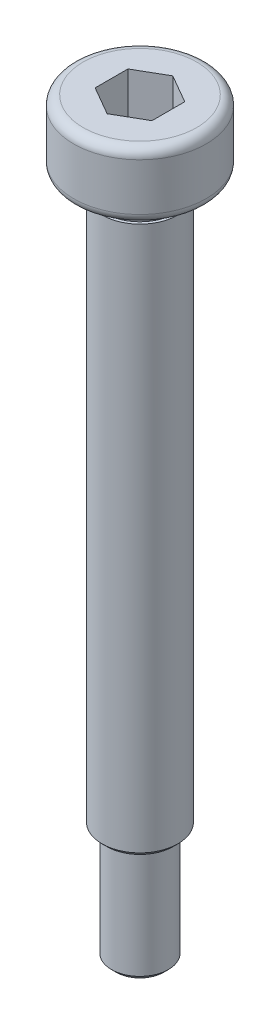
ISO-10303-21;
HEADER;
FILE_DESCRIPTION(('STEP AP214'),'2;1');
FILE_NAME('part.step','',(''),(''),'','','');
FILE_SCHEMA(('AUTOMOTIVE_DESIGN { 1 0 10303 214 1 1 1 1 }'));
ENDSEC;
DATA;
#1=APPLICATION_CONTEXT('core data for automotive mechanical design processes');
#2=APPLICATION_PROTOCOL_DEFINITION('international standard','automotive_design',2000,#1);
#3=PRODUCT_CONTEXT('',#1,'mechanical');
#4=PRODUCT('Part','Part','',(#3));
#5=PRODUCT_RELATED_PRODUCT_CATEGORY('part','',(#4));
#6=PRODUCT_DEFINITION_FORMATION('','',#4);
#7=PRODUCT_DEFINITION_CONTEXT('part definition',#1,'design');
#8=PRODUCT_DEFINITION('design','',#6,#7);
#9=PRODUCT_DEFINITION_SHAPE('','',#8);
#10=(LENGTH_UNIT() NAMED_UNIT(*) SI_UNIT(.MILLI.,.METRE.));
#11=(NAMED_UNIT(*) PLANE_ANGLE_UNIT() SI_UNIT($,.RADIAN.));
#12=(NAMED_UNIT(*) SI_UNIT($,.STERADIAN.) SOLID_ANGLE_UNIT());
#13=UNCERTAINTY_MEASURE_WITH_UNIT(LENGTH_MEASURE(1.E-05),#10,'distance_accuracy_value','');
#14=(GEOMETRIC_REPRESENTATION_CONTEXT(3) GLOBAL_UNCERTAINTY_ASSIGNED_CONTEXT((#13)) GLOBAL_UNIT_ASSIGNED_CONTEXT((#10,
#11,#12)) REPRESENTATION_CONTEXT('',''));
#15=CARTESIAN_POINT('',(0.,0.,0.));
#16=DIRECTION('',(0.,0.,1.));
#17=DIRECTION('',(1.,0.,0.));
#18=AXIS2_PLACEMENT_3D('',#15,#16,#17);
#19=CARTESIAN_POINT('',(0.,3.5,0.));
#20=DIRECTION('',(0.,1.,0.));
#21=DIRECTION('',(-1.,0.,0.));
#22=AXIS2_PLACEMENT_3D('',#19,#20,#21);
#23=CYLINDRICAL_SURFACE('',#22,1.85);
#24=CARTESIAN_POINT('',(0.,-1.,0.));
#25=DIRECTION('',(0.,1.,0.));
#26=DIRECTION('',(-1.,0.,0.));
#27=AXIS2_PLACEMENT_3D('',#24,#25,#26);
#28=CIRCLE('',#27,1.85);
#29=CARTESIAN_POINT('',(-1.85,-1.,0.));
#30=VERTEX_POINT('',#29);
#31=EDGE_CURVE('E237',#30,#30,#28,.T.);
#32=ORIENTED_EDGE('',*,*,#31,.T.);
#33=EDGE_LOOP('',(#32));
#34=FACE_BOUND('',#33,.T.);
#35=CARTESIAN_POINT('',(0.,0.,0.));
#36=DIRECTION('',(0.,1.,0.));
#37=DIRECTION('',(-1.,0.,0.));
#38=AXIS2_PLACEMENT_3D('',#35,#36,#37);
#39=CIRCLE('',#38,1.85);
#40=CARTESIAN_POINT('',(-1.85,0.,0.));
#41=VERTEX_POINT('',#40);
#42=EDGE_CURVE('E127',#41,#41,#39,.T.);
#43=ORIENTED_EDGE('',*,*,#42,.F.);
#44=EDGE_LOOP('',(#43));
#45=FACE_BOUND('',#44,.T.);
#46=ADVANCED_FACE('F19',(#34,#45),#23,.T.);
#47=CARTESIAN_POINT('',(-1.85,0.,0.));
#48=DIRECTION('',(0.,-1.,0.));
#49=DIRECTION('',(1.,0.,0.));
#50=AXIS2_PLACEMENT_3D('',#47,#48,#49);
#51=PLANE('',#50);
#52=CARTESIAN_POINT('',(0.,0.,0.));
#53=DIRECTION('',(0.,-1.,0.));
#54=DIRECTION('',(1.,0.,0.));
#55=AXIS2_PLACEMENT_3D('',#52,#53,#54);
#56=CIRCLE('',#55,3.);
#57=CARTESIAN_POINT('',(3.,0.,0.));
#58=VERTEX_POINT('',#57);
#59=EDGE_CURVE('E140',#58,#58,#56,.T.);
#60=ORIENTED_EDGE('',*,*,#59,.T.);
#61=EDGE_LOOP('',(#60));
#62=FACE_BOUND('',#61,.T.);
#63=ORIENTED_EDGE('',*,*,#42,.T.);
#64=EDGE_LOOP('',(#63));
#65=FACE_BOUND('',#64,.T.);
#66=ADVANCED_FACE('F172',(#62,#65),#51,.T.);
#67=CARTESIAN_POINT('',(0.,3.5,0.));
#68=DIRECTION('',(0.,1.,0.));
#69=DIRECTION('',(-1.,0.,0.));
#70=AXIS2_PLACEMENT_3D('',#67,#68,#69);
#71=CYLINDRICAL_SURFACE('',#70,3.5);
#72=CARTESIAN_POINT('',(0.,0.5,0.));
#73=DIRECTION('',(0.,-1.,0.));
#74=DIRECTION('',(1.,0.,0.));
#75=AXIS2_PLACEMENT_3D('',#72,#73,#74);
#76=CIRCLE('',#75,3.5);
#77=CARTESIAN_POINT('',(3.5,0.5,0.));
#78=VERTEX_POINT('',#77);
#79=EDGE_CURVE('E144',#78,#78,#76,.F.);
#80=ORIENTED_EDGE('',*,*,#79,.T.);
#81=EDGE_LOOP('',(#80));
#82=FACE_BOUND('',#81,.T.);
#83=CARTESIAN_POINT('',(0.,3.,0.));
#84=DIRECTION('',(0.,1.,0.));
#85=DIRECTION('',(-1.,0.,0.));
#86=AXIS2_PLACEMENT_3D('',#83,#84,#85);
#87=CIRCLE('',#86,3.5);
#88=CARTESIAN_POINT('',(-3.5,3.,0.));
#89=VERTEX_POINT('',#88);
#90=EDGE_CURVE('E134',#89,#89,#87,.F.);
#91=ORIENTED_EDGE('',*,*,#90,.T.);
#92=EDGE_LOOP('',(#91));
#93=FACE_BOUND('',#92,.T.);
#94=ADVANCED_FACE('F179',(#82,#93),#71,.T.);
#95=CARTESIAN_POINT('',(-3.5,3.5,0.));
#96=DIRECTION('',(0.,1.,0.));
#97=DIRECTION('',(-1.,0.,0.));
#98=AXIS2_PLACEMENT_3D('',#95,#96,#97);
#99=PLANE('',#98);
#100=CARTESIAN_POINT('',(0.,3.5,0.));
#101=DIRECTION('',(0.,1.,0.));
#102=DIRECTION('',(-1.,0.,0.));
#103=AXIS2_PLACEMENT_3D('',#100,#101,#102);
#104=CIRCLE('',#103,3.);
#105=CARTESIAN_POINT('',(-3.,3.5,0.));
#106=VERTEX_POINT('',#105);
#107=EDGE_CURVE('E143',#106,#106,#104,.T.);
#108=ORIENTED_EDGE('',*,*,#107,.T.);
#109=EDGE_LOOP('',(#108));
#110=FACE_BOUND('',#109,.T.);
#111=DIRECTION('',(-0.866025403784439,0.,-0.5));
#112=VECTOR('',#111,1.);
#113=CARTESIAN_POINT('',(1.5,3.5,-0.866025403784439));
#114=LINE('',#113,#112);
#115=CARTESIAN_POINT('',(1.5,3.5,-0.866025403784439));
#116=VERTEX_POINT('',#115);
#117=CARTESIAN_POINT('',(0.,3.5,-1.73205080756888));
#118=VERTEX_POINT('',#117);
#119=EDGE_CURVE('E36',#116,#118,#114,.T.);
#120=ORIENTED_EDGE('',*,*,#119,.F.);
#121=DIRECTION('',(0.,0.,-1.));
#122=VECTOR('',#121,1.);
#123=CARTESIAN_POINT('',(1.5,3.5,0.86602540378444));
#124=LINE('',#123,#122);
#125=CARTESIAN_POINT('',(1.5,3.5,0.86602540378444));
#126=VERTEX_POINT('',#125);
#127=EDGE_CURVE('E215',#126,#116,#124,.T.);
#128=ORIENTED_EDGE('',*,*,#127,.F.);
#129=DIRECTION('',(0.866025403784439,0.,-0.5));
#130=VECTOR('',#129,1.);
#131=CARTESIAN_POINT('',(0.,3.5,1.73205080756888));
#132=LINE('',#131,#130);
#133=CARTESIAN_POINT('',(0.,3.5,1.73205080756888));
#134=VERTEX_POINT('',#133);
#135=EDGE_CURVE('E222',#134,#126,#132,.T.);
#136=ORIENTED_EDGE('',*,*,#135,.F.);
#137=DIRECTION('',(0.866025403784439,0.,0.5));
#138=VECTOR('',#137,1.);
#139=CARTESIAN_POINT('',(-1.5,3.5,0.86602540378444));
#140=LINE('',#139,#138);
#141=CARTESIAN_POINT('',(-1.5,3.5,0.86602540378444));
#142=VERTEX_POINT('',#141);
#143=EDGE_CURVE('E84',#142,#134,#140,.T.);
#144=ORIENTED_EDGE('',*,*,#143,.F.);
#145=DIRECTION('',(0.,0.,1.));
#146=VECTOR('',#145,1.);
#147=CARTESIAN_POINT('',(-1.5,3.5,-0.866025403784439));
#148=LINE('',#147,#146);
#149=CARTESIAN_POINT('',(-1.5,3.5,-0.866025403784439));
#150=VERTEX_POINT('',#149);
#151=EDGE_CURVE('E219',#150,#142,#148,.T.);
#152=ORIENTED_EDGE('',*,*,#151,.F.);
#153=DIRECTION('',(-0.866025403784439,0.,0.5));
#154=VECTOR('',#153,1.);
#155=CARTESIAN_POINT('',(0.,3.5,-1.73205080756887));
#156=LINE('',#155,#154);
#157=EDGE_CURVE('E111',#118,#150,#156,.T.);
#158=ORIENTED_EDGE('',*,*,#157,.F.);
#159=EDGE_LOOP('',(#120,#128,#136,#144,#152,#158));
#160=FACE_BOUND('',#159,.T.);
#161=ADVANCED_FACE('F208',(#110,#160),#99,.T.);
#162=CARTESIAN_POINT('',(-1.5,-36.,0.));
#163=DIRECTION('',(0.,-1.,0.));
#164=DIRECTION('',(1.,0.,0.));
#165=AXIS2_PLACEMENT_3D('',#162,#163,#164);
#166=PLANE('',#165);
#167=CARTESIAN_POINT('',(0.,-36.,0.));
#168=DIRECTION('',(0.,-1.,0.));
#169=DIRECTION('',(1.,0.,0.));
#170=AXIS2_PLACEMENT_3D('',#167,#168,#169);
#171=CIRCLE('',#170,1.25);
#172=CARTESIAN_POINT('',(1.25,-36.,0.));
#173=VERTEX_POINT('',#172);
#174=EDGE_CURVE('E151',#173,#173,#171,.T.);
#175=ORIENTED_EDGE('',*,*,#174,.T.);
#176=EDGE_LOOP('',(#175));
#177=FACE_BOUND('',#176,.T.);
#178=ADVANCED_FACE('F211',(#177),#166,.T.);
#179=CARTESIAN_POINT('',(0.,3.5,0.));
#180=DIRECTION('',(0.,1.,0.));
#181=DIRECTION('',(-1.,0.,0.));
#182=AXIS2_PLACEMENT_3D('',#179,#180,#181);
#183=CYLINDRICAL_SURFACE('',#182,1.5);
#184=CARTESIAN_POINT('',(0.,-35.75,0.));
#185=DIRECTION('',(0.,-1.,0.));
#186=DIRECTION('',(1.,0.,0.));
#187=AXIS2_PLACEMENT_3D('',#184,#185,#186);
#188=CIRCLE('',#187,1.5);
#189=CARTESIAN_POINT('',(1.5,-35.75,0.));
#190=VERTEX_POINT('',#189);
#191=EDGE_CURVE('E148',#190,#190,#188,.F.);
#192=ORIENTED_EDGE('',*,*,#191,.T.);
#193=EDGE_LOOP('',(#192));
#194=FACE_BOUND('',#193,.T.);
#195=CARTESIAN_POINT('',(0.,-30.,0.));
#196=DIRECTION('',(0.,1.,0.));
#197=DIRECTION('',(-1.,0.,0.));
#198=AXIS2_PLACEMENT_3D('',#195,#196,#197);
#199=CIRCLE('',#198,1.5);
#200=CARTESIAN_POINT('',(-1.5,-30.,0.));
#201=VERTEX_POINT('',#200);
#202=EDGE_CURVE('E123',#201,#201,#199,.T.);
#203=ORIENTED_EDGE('',*,*,#202,.F.);
#204=EDGE_LOOP('',(#203));
#205=FACE_BOUND('',#204,.T.);
#206=ADVANCED_FACE('F259',(#194,#205),#183,.T.);
#207=CARTESIAN_POINT('',(-2.,-30.,0.));
#208=DIRECTION('',(0.,-1.,0.));
#209=DIRECTION('',(1.,0.,0.));
#210=AXIS2_PLACEMENT_3D('',#207,#208,#209);
#211=PLANE('',#210);
#212=CARTESIAN_POINT('',(0.,-30.,0.));
#213=DIRECTION('',(0.,-1.,0.));
#214=DIRECTION('',(1.,0.,0.));
#215=AXIS2_PLACEMENT_3D('',#212,#213,#214);
#216=CIRCLE('',#215,1.75);
#217=CARTESIAN_POINT('',(1.75,-30.,0.));
#218=VERTEX_POINT('',#217);
#219=EDGE_CURVE('E12',#218,#218,#216,.T.);
#220=ORIENTED_EDGE('',*,*,#219,.T.);
#221=EDGE_LOOP('',(#220));
#222=FACE_BOUND('',#221,.T.);
#223=ORIENTED_EDGE('',*,*,#202,.T.);
#224=EDGE_LOOP('',(#223));
#225=FACE_BOUND('',#224,.T.);
#226=ADVANCED_FACE('F250',(#222,#225),#211,.T.);
#227=CARTESIAN_POINT('',(0.,3.5,0.));
#228=DIRECTION('',(0.,1.,0.));
#229=DIRECTION('',(-1.,0.,0.));
#230=AXIS2_PLACEMENT_3D('',#227,#228,#229);
#231=CYLINDRICAL_SURFACE('',#230,2.);
#232=CARTESIAN_POINT('',(0.,-29.75,0.));
#233=DIRECTION('',(0.,-1.,0.));
#234=DIRECTION('',(1.,0.,0.));
#235=AXIS2_PLACEMENT_3D('',#232,#233,#234);
#236=CIRCLE('',#235,2.);
#237=CARTESIAN_POINT('',(2.,-29.75,0.));
#238=VERTEX_POINT('',#237);
#239=EDGE_CURVE('E29',#238,#238,#236,.F.);
#240=ORIENTED_EDGE('',*,*,#239,.T.);
#241=EDGE_LOOP('',(#240));
#242=FACE_BOUND('',#241,.T.);
#243=CARTESIAN_POINT('',(0.,-1.,0.));
#244=DIRECTION('',(0.,1.,0.));
#245=DIRECTION('',(-1.,0.,0.));
#246=AXIS2_PLACEMENT_3D('',#243,#244,#245);
#247=CIRCLE('',#246,2.);
#248=CARTESIAN_POINT('',(-2.,-1.,0.));
#249=VERTEX_POINT('',#248);
#250=EDGE_CURVE('E128',#249,#249,#247,.T.);
#251=ORIENTED_EDGE('',*,*,#250,.F.);
#252=EDGE_LOOP('',(#251));
#253=FACE_BOUND('',#252,.T.);
#254=ADVANCED_FACE('F157',(#242,#253),#231,.T.);
#255=CARTESIAN_POINT('',(-1.85,-1.,0.));
#256=DIRECTION('',(0.,1.,0.));
#257=DIRECTION('',(-1.,0.,0.));
#258=AXIS2_PLACEMENT_3D('',#255,#256,#257);
#259=PLANE('',#258);
#260=ORIENTED_EDGE('',*,*,#250,.T.);
#261=EDGE_LOOP('',(#260));
#262=FACE_BOUND('',#261,.T.);
#263=ORIENTED_EDGE('',*,*,#31,.F.);
#264=EDGE_LOOP('',(#263));
#265=FACE_BOUND('',#264,.T.);
#266=ADVANCED_FACE('F247',(#262,#265),#259,.T.);
#267=CARTESIAN_POINT('',(1.5,1.1,-0.866025403784439));
#268=DIRECTION('',(0.5,0.,-0.866025403784439));
#269=DIRECTION('',(-0.866025403784439,0.,-0.5));
#270=AXIS2_PLACEMENT_3D('',#267,#268,#269);
#271=PLANE('',#270);
#272=ORIENTED_EDGE('',*,*,#119,.T.);
#273=DIRECTION('',(0.,1.,0.));
#274=VECTOR('',#273,1.);
#275=CARTESIAN_POINT('',(0.,1.1,-1.73205080756887));
#276=LINE('',#275,#274);
#277=CARTESIAN_POINT('',(0.,1.1,-1.73205080756887));
#278=VERTEX_POINT('',#277);
#279=EDGE_CURVE('E66',#278,#118,#276,.T.);
#280=ORIENTED_EDGE('',*,*,#279,.F.);
#281=DIRECTION('',(-0.866025403784439,0.,-0.5));
#282=VECTOR('',#281,1.);
#283=CARTESIAN_POINT('',(1.5,1.1,-0.866025403784439));
#284=LINE('',#283,#282);
#285=CARTESIAN_POINT('',(1.5,1.1,-0.866025403784439));
#286=VERTEX_POINT('',#285);
#287=EDGE_CURVE('E235',#286,#278,#284,.T.);
#288=ORIENTED_EDGE('',*,*,#287,.F.);
#289=DIRECTION('',(0.,1.,0.));
#290=VECTOR('',#289,1.);
#291=CARTESIAN_POINT('',(1.5,1.1,-0.866025403784439));
#292=LINE('',#291,#290);
#293=EDGE_CURVE('E44',#286,#116,#292,.T.);
#294=ORIENTED_EDGE('',*,*,#293,.T.);
#295=EDGE_LOOP('',(#272,#280,#288,#294));
#296=FACE_BOUND('',#295,.T.);
#297=ADVANCED_FACE('F257',(#296),#271,.F.);
#298=CARTESIAN_POINT('',(1.5,1.1,0.86602540378444));
#299=DIRECTION('',(1.,0.,0.));
#300=DIRECTION('',(0.,1.,0.));
#301=AXIS2_PLACEMENT_3D('',#298,#299,#300);
#302=PLANE('',#301);
#303=ORIENTED_EDGE('',*,*,#127,.T.);
#304=ORIENTED_EDGE('',*,*,#293,.F.);
#305=DIRECTION('',(0.,0.,-1.));
#306=VECTOR('',#305,1.);
#307=CARTESIAN_POINT('',(1.5,1.1,0.86602540378444));
#308=LINE('',#307,#306);
#309=CARTESIAN_POINT('',(1.5,1.1,0.86602540378444));
#310=VERTEX_POINT('',#309);
#311=EDGE_CURVE('E96',#310,#286,#308,.T.);
#312=ORIENTED_EDGE('',*,*,#311,.F.);
#313=DIRECTION('',(0.,1.,0.));
#314=VECTOR('',#313,1.);
#315=CARTESIAN_POINT('',(1.5,1.1,0.86602540378444));
#316=LINE('',#315,#314);
#317=EDGE_CURVE('E88',#310,#126,#316,.T.);
#318=ORIENTED_EDGE('',*,*,#317,.T.);
#319=EDGE_LOOP('',(#303,#304,#312,#318));
#320=FACE_BOUND('',#319,.T.);
#321=ADVANCED_FACE('F330',(#320),#302,.F.);
#322=CARTESIAN_POINT('',(0.,1.1,1.73205080756888));
#323=DIRECTION('',(0.5,0.,0.866025403784439));
#324=DIRECTION('',(0.866025403784439,0.,-0.5));
#325=AXIS2_PLACEMENT_3D('',#322,#323,#324);
#326=PLANE('',#325);
#327=ORIENTED_EDGE('',*,*,#135,.T.);
#328=ORIENTED_EDGE('',*,*,#317,.F.);
#329=DIRECTION('',(0.866025403784439,0.,-0.5));
#330=VECTOR('',#329,1.);
#331=CARTESIAN_POINT('',(0.,1.1,1.73205080756888));
#332=LINE('',#331,#330);
#333=CARTESIAN_POINT('',(0.,1.1,1.73205080756888));
#334=VERTEX_POINT('',#333);
#335=EDGE_CURVE('E92',#334,#310,#332,.T.);
#336=ORIENTED_EDGE('',*,*,#335,.F.);
#337=DIRECTION('',(0.,1.,0.));
#338=VECTOR('',#337,1.);
#339=CARTESIAN_POINT('',(0.,1.1,1.73205080756888));
#340=LINE('',#339,#338);
#341=EDGE_CURVE('E77',#334,#134,#340,.T.);
#342=ORIENTED_EDGE('',*,*,#341,.T.);
#343=EDGE_LOOP('',(#327,#328,#336,#342));
#344=FACE_BOUND('',#343,.T.);
#345=ADVANCED_FACE('F93',(#344),#326,.F.);
#346=CARTESIAN_POINT('',(-1.5,1.1,0.86602540378444));
#347=DIRECTION('',(-0.5,0.,0.866025403784439));
#348=DIRECTION('',(0.866025403784439,0.,0.5));
#349=AXIS2_PLACEMENT_3D('',#346,#347,#348);
#350=PLANE('',#349);
#351=ORIENTED_EDGE('',*,*,#143,.T.);
#352=ORIENTED_EDGE('',*,*,#341,.F.);
#353=DIRECTION('',(0.866025403784439,0.,0.5));
#354=VECTOR('',#353,1.);
#355=CARTESIAN_POINT('',(-1.5,1.1,0.86602540378444));
#356=LINE('',#355,#354);
#357=CARTESIAN_POINT('',(-1.5,1.1,0.86602540378444));
#358=VERTEX_POINT('',#357);
#359=EDGE_CURVE('E81',#358,#334,#356,.T.);
#360=ORIENTED_EDGE('',*,*,#359,.F.);
#361=DIRECTION('',(0.,1.,0.));
#362=VECTOR('',#361,1.);
#363=CARTESIAN_POINT('',(-1.5,1.1,0.86602540378444));
#364=LINE('',#363,#362);
#365=EDGE_CURVE('E89',#358,#142,#364,.T.);
#366=ORIENTED_EDGE('',*,*,#365,.T.);
#367=EDGE_LOOP('',(#351,#352,#360,#366));
#368=FACE_BOUND('',#367,.T.);
#369=ADVANCED_FACE('F79',(#368),#350,.F.);
#370=CARTESIAN_POINT('',(-1.5,1.1,-0.866025403784439));
#371=DIRECTION('',(-1.,0.,0.));
#372=DIRECTION('',(0.,-1.,0.));
#373=AXIS2_PLACEMENT_3D('',#370,#371,#372);
#374=PLANE('',#373);
#375=ORIENTED_EDGE('',*,*,#151,.T.);
#376=ORIENTED_EDGE('',*,*,#365,.F.);
#377=DIRECTION('',(0.,0.,1.));
#378=VECTOR('',#377,1.);
#379=CARTESIAN_POINT('',(-1.5,1.1,-0.866025403784439));
#380=LINE('',#379,#378);
#381=CARTESIAN_POINT('',(-1.5,1.1,-0.866025403784439));
#382=VERTEX_POINT('',#381);
#383=EDGE_CURVE('E102',#382,#358,#380,.T.);
#384=ORIENTED_EDGE('',*,*,#383,.F.);
#385=DIRECTION('',(0.,1.,0.));
#386=VECTOR('',#385,1.);
#387=CARTESIAN_POINT('',(-1.5,1.1,-0.866025403784439));
#388=LINE('',#387,#386);
#389=EDGE_CURVE('E240',#382,#150,#388,.T.);
#390=ORIENTED_EDGE('',*,*,#389,.T.);
#391=EDGE_LOOP('',(#375,#376,#384,#390));
#392=FACE_BOUND('',#391,.T.);
#393=ADVANCED_FACE('F351',(#392),#374,.F.);
#394=CARTESIAN_POINT('',(0.,1.1,-1.73205080756887));
#395=DIRECTION('',(-0.5,0.,-0.866025403784439));
#396=DIRECTION('',(-0.866025403784439,0.,0.5));
#397=AXIS2_PLACEMENT_3D('',#394,#395,#396);
#398=PLANE('',#397);
#399=ORIENTED_EDGE('',*,*,#157,.T.);
#400=ORIENTED_EDGE('',*,*,#389,.F.);
#401=DIRECTION('',(-0.866025403784439,0.,0.5));
#402=VECTOR('',#401,1.);
#403=CARTESIAN_POINT('',(0.,1.1,-1.73205080756887));
#404=LINE('',#403,#402);
#405=EDGE_CURVE('E104',#278,#382,#404,.T.);
#406=ORIENTED_EDGE('',*,*,#405,.F.);
#407=ORIENTED_EDGE('',*,*,#279,.T.);
#408=EDGE_LOOP('',(#399,#400,#406,#407));
#409=FACE_BOUND('',#408,.T.);
#410=ADVANCED_FACE('F359',(#409),#398,.F.);
#411=CARTESIAN_POINT('',(0.,1.1,0.));
#412=DIRECTION('',(0.,1.,0.));
#413=DIRECTION('',(0.,0.,1.));
#414=AXIS2_PLACEMENT_3D('',#411,#412,#413);
#415=PLANE('',#414);
#416=ORIENTED_EDGE('',*,*,#287,.T.);
#417=ORIENTED_EDGE('',*,*,#405,.T.);
#418=ORIENTED_EDGE('',*,*,#383,.T.);
#419=ORIENTED_EDGE('',*,*,#359,.T.);
#420=ORIENTED_EDGE('',*,*,#335,.T.);
#421=ORIENTED_EDGE('',*,*,#311,.T.);
#422=EDGE_LOOP('',(#416,#417,#418,#419,#420,#421));
#423=FACE_BOUND('',#422,.T.);
#424=ADVANCED_FACE('F99',(#423),#415,.T.);
#425=CARTESIAN_POINT('',(0.,0.5,0.));
#426=DIRECTION('',(0.,-1.,0.));
#427=DIRECTION('',(1.,0.,0.));
#428=AXIS2_PLACEMENT_3D('',#425,#426,#427);
#429=TOROIDAL_SURFACE('',#428,3.,0.5);
#430=ORIENTED_EDGE('',*,*,#59,.F.);
#431=EDGE_LOOP('',(#430));
#432=FACE_BOUND('',#431,.T.);
#433=ORIENTED_EDGE('',*,*,#79,.F.);
#434=EDGE_LOOP('',(#433));
#435=FACE_BOUND('',#434,.T.);
#436=ADVANCED_FACE('F186',(#432,#435),#429,.T.);
#437=CARTESIAN_POINT('',(0.,3.,0.));
#438=DIRECTION('',(0.,1.,0.));
#439=DIRECTION('',(-1.,0.,0.));
#440=AXIS2_PLACEMENT_3D('',#437,#438,#439);
#441=TOROIDAL_SURFACE('',#440,3.,0.5);
#442=ORIENTED_EDGE('',*,*,#90,.F.);
#443=EDGE_LOOP('',(#442));
#444=FACE_BOUND('',#443,.T.);
#445=ORIENTED_EDGE('',*,*,#107,.F.);
#446=EDGE_LOOP('',(#445));
#447=FACE_BOUND('',#446,.T.);
#448=ADVANCED_FACE('F168',(#444,#447),#441,.T.);
#449=CARTESIAN_POINT('',(0.,-35.75,0.));
#450=DIRECTION('',(0.,1.,0.));
#451=DIRECTION('',(-1.,0.,0.));
#452=AXIS2_PLACEMENT_3D('',#449,#450,#451);
#453=CONICAL_SURFACE('',#452,1.5,0.785398163397435);
#454=ORIENTED_EDGE('',*,*,#174,.F.);
#455=EDGE_LOOP('',(#454));
#456=FACE_BOUND('',#455,.T.);
#457=ORIENTED_EDGE('',*,*,#191,.F.);
#458=EDGE_LOOP('',(#457));
#459=FACE_BOUND('',#458,.T.);
#460=ADVANCED_FACE('F161',(#456,#459),#453,.T.);
#461=CARTESIAN_POINT('',(0.,-29.75,0.));
#462=DIRECTION('',(0.,1.,0.));
#463=DIRECTION('',(-1.,0.,0.));
#464=AXIS2_PLACEMENT_3D('',#461,#462,#463);
#465=CONICAL_SURFACE('',#464,2.,0.785398163397441);
#466=ORIENTED_EDGE('',*,*,#219,.F.);
#467=EDGE_LOOP('',(#466));
#468=FACE_BOUND('',#467,.T.);
#469=ORIENTED_EDGE('',*,*,#239,.F.);
#470=EDGE_LOOP('',(#469));
#471=FACE_BOUND('',#470,.T.);
#472=ADVANCED_FACE('F22',(#468,#471),#465,.T.);
#473=CLOSED_SHELL('',(#46,#66,#94,#161,#178,#206,#226,#254,#266,#297,#321,#345,#369,#393,#410,
#424,#436,#448,#460,#472));
#474=MANIFOLD_SOLID_BREP('B1',#473);
#475=ADVANCED_BREP_SHAPE_REPRESENTATION('',(#18,#474),#14);
#476=SHAPE_DEFINITION_REPRESENTATION(#9,#475);
ENDSEC;
END-ISO-10303-21;
